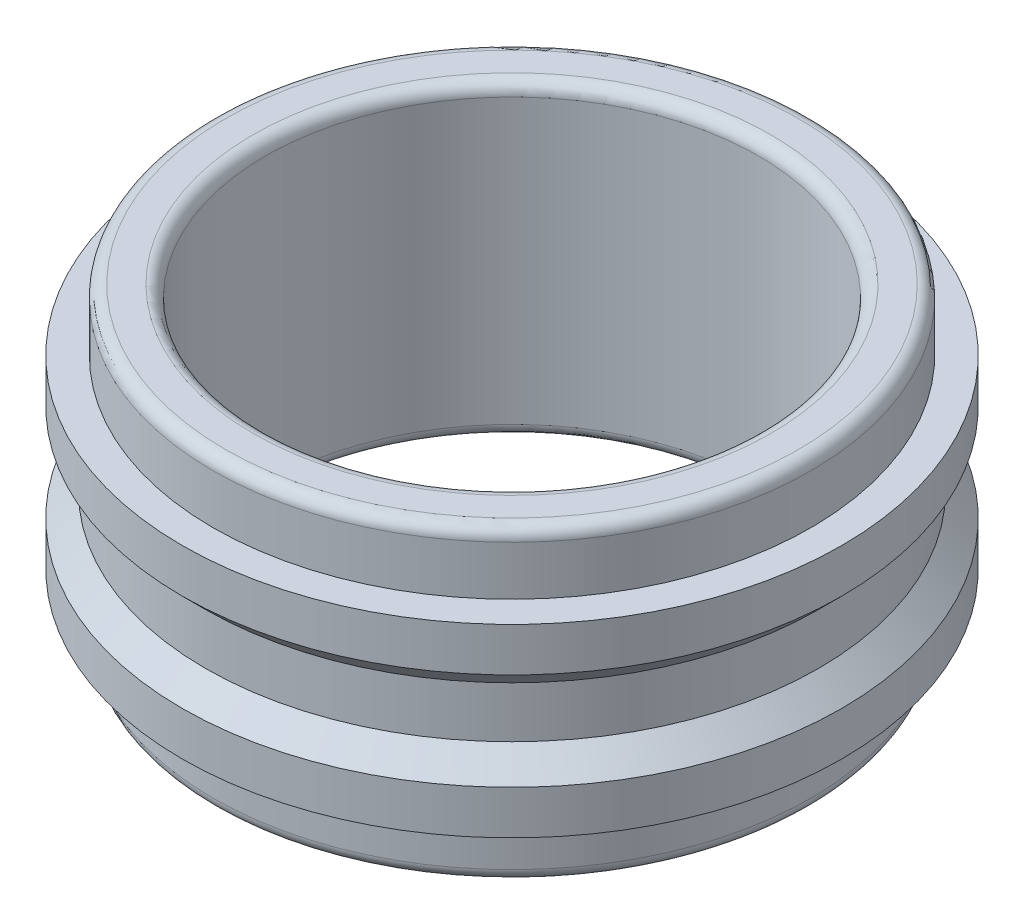
ISO-10303-21;
HEADER;
FILE_DESCRIPTION(('STEP AP214'),'2;1');
FILE_NAME('part.step','',(''),(''),'','','');
FILE_SCHEMA(('AUTOMOTIVE_DESIGN { 1 0 10303 214 1 1 1 1 }'));
ENDSEC;
DATA;
#1=APPLICATION_CONTEXT('core data for automotive mechanical design processes');
#2=APPLICATION_PROTOCOL_DEFINITION('international standard','automotive_design',2000,#1);
#3=PRODUCT_CONTEXT('',#1,'mechanical');
#4=PRODUCT('Part','Part','',(#3));
#5=PRODUCT_RELATED_PRODUCT_CATEGORY('part','',(#4));
#6=PRODUCT_DEFINITION_FORMATION('','',#4);
#7=PRODUCT_DEFINITION_CONTEXT('part definition',#1,'design');
#8=PRODUCT_DEFINITION('design','',#6,#7);
#9=PRODUCT_DEFINITION_SHAPE('','',#8);
#10=(LENGTH_UNIT() NAMED_UNIT(*) SI_UNIT(.MILLI.,.METRE.));
#11=(NAMED_UNIT(*) PLANE_ANGLE_UNIT() SI_UNIT($,.RADIAN.));
#12=(NAMED_UNIT(*) SI_UNIT($,.STERADIAN.) SOLID_ANGLE_UNIT());
#13=UNCERTAINTY_MEASURE_WITH_UNIT(LENGTH_MEASURE(1.E-05),#10,'distance_accuracy_value','');
#14=(GEOMETRIC_REPRESENTATION_CONTEXT(3) GLOBAL_UNCERTAINTY_ASSIGNED_CONTEXT((#13)) GLOBAL_UNIT_ASSIGNED_CONTEXT((#10,
#11,#12)) REPRESENTATION_CONTEXT('',''));
#15=CARTESIAN_POINT('',(0.,0.,0.));
#16=DIRECTION('',(0.,0.,1.));
#17=DIRECTION('',(1.,0.,0.));
#18=AXIS2_PLACEMENT_3D('',#15,#16,#17);
#19=CARTESIAN_POINT('',(0.,5.,0.));
#20=DIRECTION('',(0.,-1.,0.));
#21=DIRECTION('',(0.,0.,-1.));
#22=AXIS2_PLACEMENT_3D('',#19,#20,#21);
#23=CYLINDRICAL_SURFACE('',#22,5.35);
#24=CARTESIAN_POINT('',(0.,1.,0.));
#25=DIRECTION('',(0.,1.,0.));
#26=DIRECTION('',(0.,0.,1.));
#27=AXIS2_PLACEMENT_3D('',#24,#25,#26);
#28=CIRCLE('',#27,5.35);
#29=CARTESIAN_POINT('',(0.,1.,5.35));
#30=VERTEX_POINT('',#29);
#31=EDGE_CURVE('E92',#30,#30,#28,.T.);
#32=ORIENTED_EDGE('',*,*,#31,.T.);
#33=EDGE_LOOP('',(#32));
#34=FACE_BOUND('',#33,.T.);
#35=CARTESIAN_POINT('',(0.,1.7107864376269,0.));
#36=DIRECTION('',(0.,-1.,0.));
#37=DIRECTION('',(0.,0.,-1.));
#38=AXIS2_PLACEMENT_3D('',#35,#36,#37);
#39=CIRCLE('',#38,5.35);
#40=CARTESIAN_POINT('',(0.,1.7107864376269,-5.35));
#41=VERTEX_POINT('',#40);
#42=EDGE_CURVE('E75',#41,#41,#39,.F.);
#43=ORIENTED_EDGE('',*,*,#42,.F.);
#44=EDGE_LOOP('',(#43));
#45=FACE_BOUND('',#44,.T.);
#46=ADVANCED_FACE('F34',(#34,#45),#23,.T.);
#47=CARTESIAN_POINT('',(0.,4.,0.));
#48=DIRECTION('',(0.,1.,0.));
#49=DIRECTION('',(0.,0.,1.));
#50=AXIS2_PLACEMENT_3D('',#47,#48,#49);
#51=CIRCLE('',#50,5.35);
#52=CARTESIAN_POINT('',(0.,4.,5.35));
#53=VERTEX_POINT('',#52);
#54=EDGE_CURVE('E74',#53,#53,#51,.T.);
#55=ORIENTED_EDGE('',*,*,#54,.F.);
#56=EDGE_LOOP('',(#55));
#57=FACE_BOUND('',#56,.T.);
#58=CARTESIAN_POINT('',(0.,3.28921356237309,0.));
#59=DIRECTION('',(0.,1.,0.));
#60=DIRECTION('',(0.,0.,1.));
#61=AXIS2_PLACEMENT_3D('',#58,#59,#60);
#62=CIRCLE('',#61,5.35);
#63=CARTESIAN_POINT('',(0.,3.28921356237309,5.35));
#64=VERTEX_POINT('',#63);
#65=EDGE_CURVE('E80',#64,#64,#62,.F.);
#66=ORIENTED_EDGE('',*,*,#65,.F.);
#67=EDGE_LOOP('',(#66));
#68=FACE_BOUND('',#67,.T.);
#69=ADVANCED_FACE('F117',(#57,#68),#23,.T.);
#70=CARTESIAN_POINT('',(0.,0.,0.));
#71=DIRECTION('',(0.,1.,0.));
#72=DIRECTION('',(0.,0.,1.));
#73=AXIS2_PLACEMENT_3D('',#70,#71,#72);
#74=PLANE('',#73);
#75=CARTESIAN_POINT('',(0.,0.,0.));
#76=DIRECTION('',(0.,1.,0.));
#77=DIRECTION('',(0.,0.,1.));
#78=AXIS2_PLACEMENT_3D('',#75,#76,#77);
#79=CIRCLE('',#78,4.2);
#80=CARTESIAN_POINT('',(0.,0.,4.2));
#81=VERTEX_POINT('',#80);
#82=EDGE_CURVE('E66',#81,#81,#79,.T.);
#83=ORIENTED_EDGE('',*,*,#82,.T.);
#84=EDGE_LOOP('',(#83));
#85=FACE_BOUND('',#84,.T.);
#86=CARTESIAN_POINT('',(0.,0.,0.));
#87=DIRECTION('',(0.,1.,0.));
#88=DIRECTION('',(0.,0.,1.));
#89=AXIS2_PLACEMENT_3D('',#86,#87,#88);
#90=CIRCLE('',#89,4.65);
#91=CARTESIAN_POINT('',(0.,0.,4.65));
#92=VERTEX_POINT('',#91);
#93=EDGE_CURVE('E70',#92,#92,#90,.F.);
#94=ORIENTED_EDGE('',*,*,#93,.T.);
#95=EDGE_LOOP('',(#94));
#96=FACE_BOUND('',#95,.T.);
#97=ADVANCED_FACE('F119',(#85,#96),#74,.F.);
#98=CARTESIAN_POINT('',(0.,5.,0.));
#99=DIRECTION('',(0.,1.,0.));
#100=DIRECTION('',(0.,0.,1.));
#101=AXIS2_PLACEMENT_3D('',#98,#99,#100);
#102=PLANE('',#101);
#103=CARTESIAN_POINT('',(0.,5.,0.));
#104=DIRECTION('',(0.,1.,0.));
#105=DIRECTION('',(0.,0.,1.));
#106=AXIS2_PLACEMENT_3D('',#103,#104,#105);
#107=CIRCLE('',#106,4.2);
#108=CARTESIAN_POINT('',(0.,5.,4.2));
#109=VERTEX_POINT('',#108);
#110=EDGE_CURVE('E42',#109,#109,#107,.F.);
#111=ORIENTED_EDGE('',*,*,#110,.T.);
#112=EDGE_LOOP('',(#111));
#113=FACE_BOUND('',#112,.T.);
#114=CARTESIAN_POINT('',(0.,5.,0.));
#115=DIRECTION('',(0.,1.,0.));
#116=DIRECTION('',(0.,0.,1.));
#117=AXIS2_PLACEMENT_3D('',#114,#115,#116);
#118=CIRCLE('',#117,4.65);
#119=CARTESIAN_POINT('',(0.,5.,4.65));
#120=VERTEX_POINT('',#119);
#121=EDGE_CURVE('E48',#120,#120,#118,.T.);
#122=ORIENTED_EDGE('',*,*,#121,.T.);
#123=EDGE_LOOP('',(#122));
#124=FACE_BOUND('',#123,.T.);
#125=ADVANCED_FACE('F126',(#113,#124),#102,.T.);
#126=CARTESIAN_POINT('',(0.,5.,0.));
#127=DIRECTION('',(0.,-1.,0.));
#128=DIRECTION('',(0.,0.,-1.));
#129=AXIS2_PLACEMENT_3D('',#126,#127,#128);
#130=CYLINDRICAL_SURFACE('',#129,4.);
#131=CARTESIAN_POINT('',(0.,0.2,0.));
#132=DIRECTION('',(0.,1.,0.));
#133=DIRECTION('',(0.,0.,1.));
#134=AXIS2_PLACEMENT_3D('',#131,#132,#133);
#135=CIRCLE('',#134,4.);
#136=CARTESIAN_POINT('',(0.,0.2,4.));
#137=VERTEX_POINT('',#136);
#138=EDGE_CURVE('E59',#137,#137,#135,.F.);
#139=ORIENTED_EDGE('',*,*,#138,.T.);
#140=EDGE_LOOP('',(#139));
#141=FACE_BOUND('',#140,.T.);
#142=CARTESIAN_POINT('',(0.,4.8,0.));
#143=DIRECTION('',(0.,1.,0.));
#144=DIRECTION('',(0.,0.,1.));
#145=AXIS2_PLACEMENT_3D('',#142,#143,#144);
#146=CIRCLE('',#145,4.);
#147=CARTESIAN_POINT('',(0.,4.8,4.));
#148=VERTEX_POINT('',#147);
#149=EDGE_CURVE('E63',#148,#148,#146,.T.);
#150=ORIENTED_EDGE('',*,*,#149,.T.);
#151=EDGE_LOOP('',(#150));
#152=FACE_BOUND('',#151,.T.);
#153=ADVANCED_FACE('F150',(#141,#152),#130,.F.);
#154=CARTESIAN_POINT('',(0.,4.,0.));
#155=DIRECTION('',(0.,1.,0.));
#156=DIRECTION('',(0.,0.,1.));
#157=AXIS2_PLACEMENT_3D('',#154,#155,#156);
#158=PLANE('',#157);
#159=CARTESIAN_POINT('',(0.,4.,0.));
#160=DIRECTION('',(0.,1.,0.));
#161=DIRECTION('',(0.,0.,1.));
#162=AXIS2_PLACEMENT_3D('',#159,#160,#161);
#163=CIRCLE('',#162,4.85);
#164=CARTESIAN_POINT('',(0.,4.,4.85));
#165=VERTEX_POINT('',#164);
#166=EDGE_CURVE('E88',#165,#165,#163,.T.);
#167=ORIENTED_EDGE('',*,*,#166,.F.);
#168=EDGE_LOOP('',(#167));
#169=FACE_BOUND('',#168,.T.);
#170=ORIENTED_EDGE('',*,*,#54,.T.);
#171=EDGE_LOOP('',(#170));
#172=FACE_BOUND('',#171,.T.);
#173=ADVANCED_FACE('F152',(#169,#172),#158,.T.);
#174=CARTESIAN_POINT('',(0.,4.,0.));
#175=DIRECTION('',(0.,1.,0.));
#176=DIRECTION('',(0.,0.,1.));
#177=AXIS2_PLACEMENT_3D('',#174,#175,#176);
#178=CYLINDRICAL_SURFACE('',#177,4.85);
#179=CARTESIAN_POINT('',(0.,4.8,0.));
#180=DIRECTION('',(0.,1.,0.));
#181=DIRECTION('',(0.,0.,1.));
#182=AXIS2_PLACEMENT_3D('',#179,#180,#181);
#183=CIRCLE('',#182,4.85);
#184=CARTESIAN_POINT('',(0.,4.8,4.85));
#185=VERTEX_POINT('',#184);
#186=EDGE_CURVE('E10',#185,#185,#183,.F.);
#187=ORIENTED_EDGE('',*,*,#186,.T.);
#188=EDGE_LOOP('',(#187));
#189=FACE_BOUND('',#188,.T.);
#190=ORIENTED_EDGE('',*,*,#166,.T.);
#191=EDGE_LOOP('',(#190));
#192=FACE_BOUND('',#191,.T.);
#193=ADVANCED_FACE('F159',(#189,#192),#178,.T.);
#194=CARTESIAN_POINT('',(0.,1.,0.));
#195=DIRECTION('',(0.,1.,0.));
#196=DIRECTION('',(0.,0.,1.));
#197=AXIS2_PLACEMENT_3D('',#194,#195,#196);
#198=PLANE('',#197);
#199=CARTESIAN_POINT('',(0.,1.,0.));
#200=DIRECTION('',(0.,1.,0.));
#201=DIRECTION('',(0.,0.,1.));
#202=AXIS2_PLACEMENT_3D('',#199,#200,#201);
#203=CIRCLE('',#202,4.85);
#204=CARTESIAN_POINT('',(0.,1.,4.85));
#205=VERTEX_POINT('',#204);
#206=EDGE_CURVE('E79',#205,#205,#203,.T.);
#207=ORIENTED_EDGE('',*,*,#206,.T.);
#208=EDGE_LOOP('',(#207));
#209=FACE_BOUND('',#208,.T.);
#210=ORIENTED_EDGE('',*,*,#31,.F.);
#211=EDGE_LOOP('',(#210));
#212=FACE_BOUND('',#211,.T.);
#213=ADVANCED_FACE('F165',(#209,#212),#198,.F.);
#214=CARTESIAN_POINT('',(0.,0.,0.));
#215=DIRECTION('',(0.,1.,0.));
#216=DIRECTION('',(0.,0.,1.));
#217=AXIS2_PLACEMENT_3D('',#214,#215,#216);
#218=CYLINDRICAL_SURFACE('',#217,4.85);
#219=CARTESIAN_POINT('',(0.,0.2,0.));
#220=DIRECTION('',(0.,1.,0.));
#221=DIRECTION('',(0.,0.,1.));
#222=AXIS2_PLACEMENT_3D('',#219,#220,#221);
#223=CIRCLE('',#222,4.85);
#224=CARTESIAN_POINT('',(0.,0.2,4.85));
#225=VERTEX_POINT('',#224);
#226=EDGE_CURVE('E53',#225,#225,#223,.T.);
#227=ORIENTED_EDGE('',*,*,#226,.T.);
#228=EDGE_LOOP('',(#227));
#229=FACE_BOUND('',#228,.T.);
#230=ORIENTED_EDGE('',*,*,#206,.F.);
#231=EDGE_LOOP('',(#230));
#232=FACE_BOUND('',#231,.T.);
#233=ADVANCED_FACE('F168',(#229,#232),#218,.T.);
#234=CARTESIAN_POINT('',(0.,1.5,0.));
#235=DIRECTION('',(0.,-1.,0.));
#236=DIRECTION('',(0.,0.,-1.));
#237=AXIS2_PLACEMENT_3D('',#234,#235,#236);
#238=CONICAL_SURFACE('',#237,5.5607864376269,0.785398163397448);
#239=CARTESIAN_POINT('',(0.,2.08578643762691,0.));
#240=DIRECTION('',(0.,-1.,0.));
#241=DIRECTION('',(0.,0.,-1.));
#242=AXIS2_PLACEMENT_3D('',#239,#240,#241);
#243=CIRCLE('',#242,4.975);
#244=CARTESIAN_POINT('',(0.,2.08578643762691,-4.975));
#245=VERTEX_POINT('',#244);
#246=EDGE_CURVE('E84',#245,#245,#243,.T.);
#247=ORIENTED_EDGE('',*,*,#246,.T.);
#248=EDGE_LOOP('',(#247));
#249=FACE_BOUND('',#248,.T.);
#250=ORIENTED_EDGE('',*,*,#42,.T.);
#251=EDGE_LOOP('',(#250));
#252=FACE_BOUND('',#251,.T.);
#253=ADVANCED_FACE('F113',(#249,#252),#238,.T.);
#254=CARTESIAN_POINT('',(0.,2.91421356237309,0.));
#255=DIRECTION('',(0.,1.,0.));
#256=DIRECTION('',(0.,0.,1.));
#257=AXIS2_PLACEMENT_3D('',#254,#255,#256);
#258=CONICAL_SURFACE('',#257,4.975,0.785398163397447);
#259=CARTESIAN_POINT('',(0.,2.91421356237309,0.));
#260=DIRECTION('',(0.,-1.,0.));
#261=DIRECTION('',(0.,0.,-1.));
#262=AXIS2_PLACEMENT_3D('',#259,#260,#261);
#263=CIRCLE('',#262,4.975);
#264=CARTESIAN_POINT('',(0.,2.91421356237309,-4.975));
#265=VERTEX_POINT('',#264);
#266=EDGE_CURVE('E102',#265,#265,#263,.T.);
#267=ORIENTED_EDGE('',*,*,#266,.F.);
#268=EDGE_LOOP('',(#267));
#269=FACE_BOUND('',#268,.T.);
#270=ORIENTED_EDGE('',*,*,#65,.T.);
#271=EDGE_LOOP('',(#270));
#272=FACE_BOUND('',#271,.T.);
#273=ADVANCED_FACE('F110',(#269,#272),#258,.T.);
#274=CARTESIAN_POINT('',(0.,0.,0.));
#275=DIRECTION('',(0.,-1.,0.));
#276=DIRECTION('',(0.,0.,-1.));
#277=AXIS2_PLACEMENT_3D('',#274,#275,#276);
#278=CYLINDRICAL_SURFACE('',#277,4.975);
#279=ORIENTED_EDGE('',*,*,#266,.T.);
#280=EDGE_LOOP('',(#279));
#281=FACE_BOUND('',#280,.T.);
#282=ORIENTED_EDGE('',*,*,#246,.F.);
#283=EDGE_LOOP('',(#282));
#284=FACE_BOUND('',#283,.T.);
#285=ADVANCED_FACE('F107',(#281,#284),#278,.T.);
#286=CARTESIAN_POINT('',(0.,0.2,0.));
#287=DIRECTION('',(0.,1.,0.));
#288=DIRECTION('',(0.,0.,1.));
#289=AXIS2_PLACEMENT_3D('',#286,#287,#288);
#290=TOROIDAL_SURFACE('',#289,4.2,0.2);
#291=ORIENTED_EDGE('',*,*,#138,.F.);
#292=EDGE_LOOP('',(#291));
#293=FACE_BOUND('',#292,.T.);
#294=ORIENTED_EDGE('',*,*,#82,.F.);
#295=EDGE_LOOP('',(#294));
#296=FACE_BOUND('',#295,.T.);
#297=ADVANCED_FACE('F133',(#293,#296),#290,.T.);
#298=CARTESIAN_POINT('',(0.,0.2,0.));
#299=DIRECTION('',(0.,1.,0.));
#300=DIRECTION('',(0.,0.,1.));
#301=AXIS2_PLACEMENT_3D('',#298,#299,#300);
#302=TOROIDAL_SURFACE('',#301,4.65,0.2);
#303=ORIENTED_EDGE('',*,*,#93,.F.);
#304=EDGE_LOOP('',(#303));
#305=FACE_BOUND('',#304,.T.);
#306=ORIENTED_EDGE('',*,*,#226,.F.);
#307=EDGE_LOOP('',(#306));
#308=FACE_BOUND('',#307,.T.);
#309=ADVANCED_FACE('F136',(#305,#308),#302,.T.);
#310=CARTESIAN_POINT('',(0.,4.8,0.));
#311=DIRECTION('',(0.,1.,0.));
#312=DIRECTION('',(0.,0.,1.));
#313=AXIS2_PLACEMENT_3D('',#310,#311,#312);
#314=TOROIDAL_SURFACE('',#313,4.2,0.2);
#315=ORIENTED_EDGE('',*,*,#110,.F.);
#316=EDGE_LOOP('',(#315));
#317=FACE_BOUND('',#316,.T.);
#318=ORIENTED_EDGE('',*,*,#149,.F.);
#319=EDGE_LOOP('',(#318));
#320=FACE_BOUND('',#319,.T.);
#321=ADVANCED_FACE('F139',(#317,#320),#314,.T.);
#322=CARTESIAN_POINT('',(0.,4.8,0.));
#323=DIRECTION('',(0.,1.,0.));
#324=DIRECTION('',(0.,0.,1.));
#325=AXIS2_PLACEMENT_3D('',#322,#323,#324);
#326=TOROIDAL_SURFACE('',#325,4.65,0.2);
#327=ORIENTED_EDGE('',*,*,#186,.F.);
#328=EDGE_LOOP('',(#327));
#329=FACE_BOUND('',#328,.T.);
#330=ORIENTED_EDGE('',*,*,#121,.F.);
#331=EDGE_LOOP('',(#330));
#332=FACE_BOUND('',#331,.T.);
#333=ADVANCED_FACE('F36',(#329,#332),#326,.T.);
#334=CLOSED_SHELL('',(#46,#69,#97,#125,#153,#173,#193,#213,#233,#253,#273,#285,#297,#309,#321,#333));
#335=MANIFOLD_SOLID_BREP('B2',#334);
#336=ADVANCED_BREP_SHAPE_REPRESENTATION('',(#18,#335),#14);
#337=SHAPE_DEFINITION_REPRESENTATION(#9,#336);
ENDSEC;
END-ISO-10303-21;
